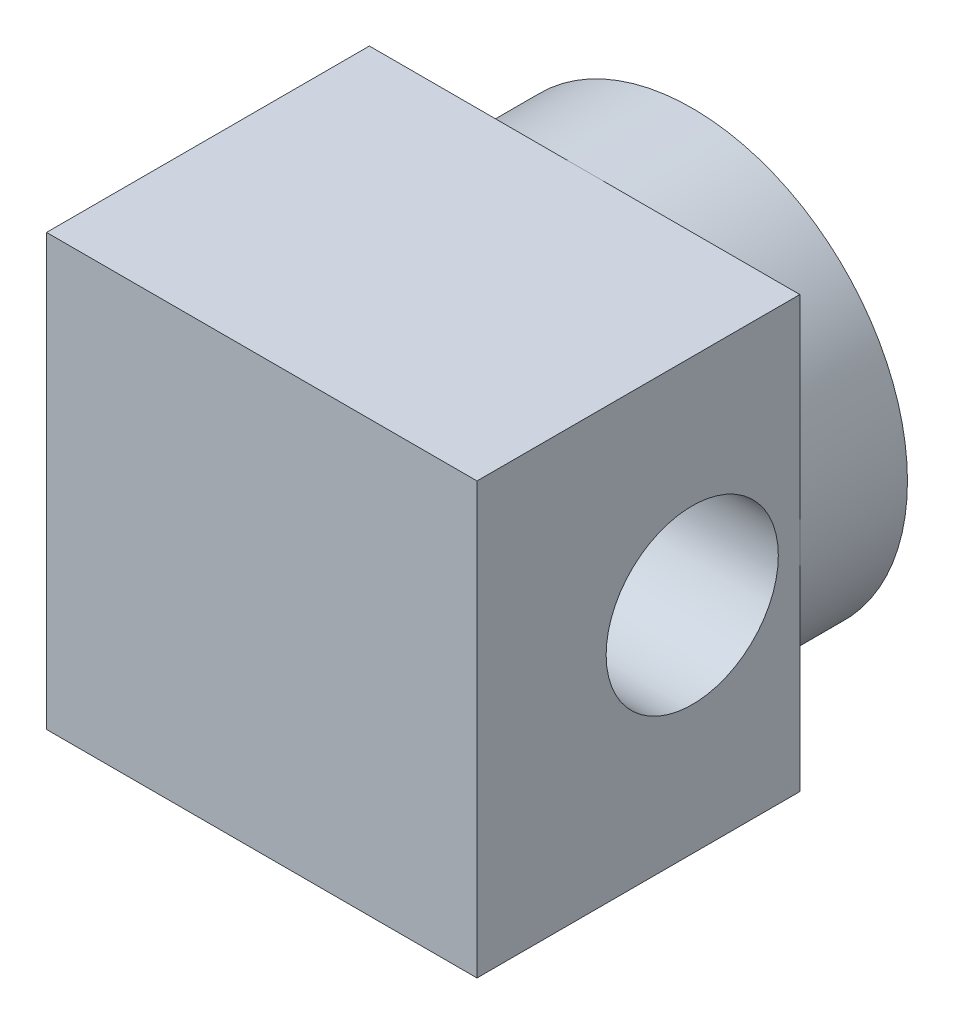
ISO-10303-21;
HEADER;
FILE_DESCRIPTION(('STEP AP214'),'2;1');
FILE_NAME('part.step','',(''),(''),'','','');
FILE_SCHEMA(('AUTOMOTIVE_DESIGN { 1 0 10303 214 1 1 1 1 }'));
ENDSEC;
DATA;
#1=APPLICATION_CONTEXT('core data for automotive mechanical design processes');
#2=APPLICATION_PROTOCOL_DEFINITION('international standard','automotive_design',2000,#1);
#3=PRODUCT_CONTEXT('',#1,'mechanical');
#4=PRODUCT('Part','Part','',(#3));
#5=PRODUCT_RELATED_PRODUCT_CATEGORY('part','',(#4));
#6=PRODUCT_DEFINITION_FORMATION('','',#4);
#7=PRODUCT_DEFINITION_CONTEXT('part definition',#1,'design');
#8=PRODUCT_DEFINITION('design','',#6,#7);
#9=PRODUCT_DEFINITION_SHAPE('','',#8);
#10=(LENGTH_UNIT() NAMED_UNIT(*) SI_UNIT(.MILLI.,.METRE.));
#11=(NAMED_UNIT(*) PLANE_ANGLE_UNIT() SI_UNIT($,.RADIAN.));
#12=(NAMED_UNIT(*) SI_UNIT($,.STERADIAN.) SOLID_ANGLE_UNIT());
#13=UNCERTAINTY_MEASURE_WITH_UNIT(LENGTH_MEASURE(1.E-05),#10,'distance_accuracy_value','');
#14=(GEOMETRIC_REPRESENTATION_CONTEXT(3) GLOBAL_UNCERTAINTY_ASSIGNED_CONTEXT((#13)) GLOBAL_UNIT_ASSIGNED_CONTEXT((#10,
#11,#12)) REPRESENTATION_CONTEXT('',''));
#15=CARTESIAN_POINT('',(0.,0.,0.));
#16=DIRECTION('',(0.,0.,1.));
#17=DIRECTION('',(1.,0.,0.));
#18=AXIS2_PLACEMENT_3D('',#15,#16,#17);
#19=CARTESIAN_POINT('',(0.,0.,10.));
#20=DIRECTION('',(0.,0.,-1.));
#21=DIRECTION('',(-1.,0.,0.));
#22=AXIS2_PLACEMENT_3D('',#19,#20,#21);
#23=CYLINDRICAL_SURFACE('',#22,5.);
#24=CARTESIAN_POINT('',(0.,0.,0.));
#25=DIRECTION('',(0.,0.,1.));
#26=DIRECTION('',(1.,0.,0.));
#27=AXIS2_PLACEMENT_3D('',#24,#25,#26);
#28=CIRCLE('',#27,5.);
#29=CARTESIAN_POINT('',(5.,0.,0.));
#30=VERTEX_POINT('',#29);
#31=EDGE_CURVE('E147',#30,#30,#28,.T.);
#32=ORIENTED_EDGE('',*,*,#31,.T.);
#33=EDGE_LOOP('',(#32));
#34=FACE_BOUND('',#33,.T.);
#35=CARTESIAN_POINT('',(0.,0.,2.5));
#36=DIRECTION('',(0.,0.,1.));
#37=DIRECTION('',(1.,0.,0.));
#38=AXIS2_PLACEMENT_3D('',#35,#36,#37);
#39=CIRCLE('',#38,5.);
#40=CARTESIAN_POINT('',(5.,0.,2.5));
#41=VERTEX_POINT('',#40);
#42=CARTESIAN_POINT('',(0.,5.,2.5));
#43=VERTEX_POINT('',#42);
#44=EDGE_CURVE('E11',#41,#43,#39,.T.);
#45=ORIENTED_EDGE('',*,*,#44,.F.);
#46=CARTESIAN_POINT('',(0.,-5.,2.5));
#47=VERTEX_POINT('',#46);
#48=EDGE_CURVE('E42',#47,#41,#39,.T.);
#49=ORIENTED_EDGE('',*,*,#48,.F.);
#50=CARTESIAN_POINT('',(-5.,0.,2.5));
#51=VERTEX_POINT('',#50);
#52=EDGE_CURVE('E58',#51,#47,#39,.T.);
#53=ORIENTED_EDGE('',*,*,#52,.F.);
#54=EDGE_CURVE('E48',#43,#51,#39,.T.);
#55=ORIENTED_EDGE('',*,*,#54,.F.);
#56=EDGE_LOOP('',(#45,#49,#53,#55));
#57=FACE_BOUND('',#56,.T.);
#58=ADVANCED_FACE('F39',(#34,#57),#23,.T.);
#59=CARTESIAN_POINT('',(0.,0.,0.));
#60=DIRECTION('',(0.,0.,1.));
#61=DIRECTION('',(1.,0.,0.));
#62=AXIS2_PLACEMENT_3D('',#59,#60,#61);
#63=PLANE('',#62);
#64=ORIENTED_EDGE('',*,*,#31,.F.);
#65=EDGE_LOOP('',(#64));
#66=FACE_BOUND('',#65,.T.);
#67=ADVANCED_FACE('F204',(#66),#63,.F.);
#68=CARTESIAN_POINT('',(0.,0.,2.5));
#69=DIRECTION('',(0.,0.,1.));
#70=DIRECTION('',(1.,0.,0.));
#71=AXIS2_PLACEMENT_3D('',#68,#69,#70);
#72=PLANE('',#71);
#73=DIRECTION('',(0.,1.,0.));
#74=VECTOR('',#73,1.);
#75=CARTESIAN_POINT('',(5.,5.,2.5));
#76=LINE('',#75,#74);
#77=CARTESIAN_POINT('',(5.,5.,2.5));
#78=VERTEX_POINT('',#77);
#79=EDGE_CURVE('E90',#41,#78,#76,.T.);
#80=ORIENTED_EDGE('',*,*,#79,.F.);
#81=ORIENTED_EDGE('',*,*,#44,.T.);
#82=DIRECTION('',(-1.,0.,0.));
#83=VECTOR('',#82,1.);
#84=CARTESIAN_POINT('',(-5.,5.,2.5));
#85=LINE('',#84,#83);
#86=EDGE_CURVE('E107',#78,#43,#85,.T.);
#87=ORIENTED_EDGE('',*,*,#86,.F.);
#88=EDGE_LOOP('',(#80,#81,#87));
#89=FACE_BOUND('',#88,.T.);
#90=ADVANCED_FACE('F114',(#89),#72,.F.);
#91=CARTESIAN_POINT('',(-5.,5.,2.5));
#92=VERTEX_POINT('',#91);
#93=EDGE_CURVE('E118',#43,#92,#85,.T.);
#94=ORIENTED_EDGE('',*,*,#93,.F.);
#95=ORIENTED_EDGE('',*,*,#54,.T.);
#96=DIRECTION('',(0.,-1.,0.));
#97=VECTOR('',#96,1.);
#98=CARTESIAN_POINT('',(-5.,5.,2.5));
#99=LINE('',#98,#97);
#100=EDGE_CURVE('E122',#92,#51,#99,.T.);
#101=ORIENTED_EDGE('',*,*,#100,.F.);
#102=EDGE_LOOP('',(#94,#95,#101));
#103=FACE_BOUND('',#102,.T.);
#104=ADVANCED_FACE('F168',(#103),#72,.F.);
#105=CARTESIAN_POINT('',(-5.,-5.,2.5));
#106=VERTEX_POINT('',#105);
#107=EDGE_CURVE('E117',#51,#106,#99,.T.);
#108=ORIENTED_EDGE('',*,*,#107,.F.);
#109=ORIENTED_EDGE('',*,*,#52,.T.);
#110=DIRECTION('',(1.,0.,0.));
#111=VECTOR('',#110,1.);
#112=CARTESIAN_POINT('',(-5.,-5.,2.5));
#113=LINE('',#112,#111);
#114=EDGE_CURVE('E112',#106,#47,#113,.T.);
#115=ORIENTED_EDGE('',*,*,#114,.F.);
#116=EDGE_LOOP('',(#108,#109,#115));
#117=FACE_BOUND('',#116,.T.);
#118=ADVANCED_FACE('F169',(#117),#72,.F.);
#119=CARTESIAN_POINT('',(5.,5.,2.5));
#120=DIRECTION('',(1.,0.,0.));
#121=DIRECTION('',(0.,1.,0.));
#122=AXIS2_PLACEMENT_3D('',#119,#120,#121);
#123=PLANE('',#122);
#124=CARTESIAN_POINT('',(5.,0.,5.));
#125=DIRECTION('',(1.,0.,0.));
#126=DIRECTION('',(0.,0.,-1.));
#127=AXIS2_PLACEMENT_3D('',#124,#125,#126);
#128=CIRCLE('',#127,2.);
#129=CARTESIAN_POINT('',(5.,0.,3.));
#130=VERTEX_POINT('',#129);
#131=EDGE_CURVE('E186',#130,#130,#128,.T.);
#132=ORIENTED_EDGE('',*,*,#131,.F.);
#133=EDGE_LOOP('',(#132));
#134=FACE_BOUND('',#133,.T.);
#135=CARTESIAN_POINT('',(5.,-5.,2.5));
#136=VERTEX_POINT('',#135);
#137=EDGE_CURVE('E98',#136,#41,#76,.T.);
#138=ORIENTED_EDGE('',*,*,#137,.T.);
#139=ORIENTED_EDGE('',*,*,#79,.T.);
#140=DIRECTION('',(0.,0.,1.));
#141=VECTOR('',#140,1.);
#142=CARTESIAN_POINT('',(5.,5.,2.5));
#143=LINE('',#142,#141);
#144=CARTESIAN_POINT('',(5.,5.,10.));
#145=VERTEX_POINT('',#144);
#146=EDGE_CURVE('E94',#78,#145,#143,.T.);
#147=ORIENTED_EDGE('',*,*,#146,.T.);
#148=DIRECTION('',(0.,1.,0.));
#149=VECTOR('',#148,1.);
#150=CARTESIAN_POINT('',(5.,5.,10.));
#151=LINE('',#150,#149);
#152=CARTESIAN_POINT('',(5.,-5.,10.));
#153=VERTEX_POINT('',#152);
#154=EDGE_CURVE('E132',#153,#145,#151,.T.);
#155=ORIENTED_EDGE('',*,*,#154,.F.);
#156=DIRECTION('',(0.,0.,1.));
#157=VECTOR('',#156,1.);
#158=CARTESIAN_POINT('',(5.,-5.,2.5));
#159=LINE('',#158,#157);
#160=EDGE_CURVE('E143',#136,#153,#159,.T.);
#161=ORIENTED_EDGE('',*,*,#160,.F.);
#162=EDGE_LOOP('',(#138,#139,#147,#155,#161));
#163=FACE_BOUND('',#162,.T.);
#164=ADVANCED_FACE('F92',(#134,#163),#123,.T.);
#165=CARTESIAN_POINT('',(-5.,-5.,2.5));
#166=DIRECTION('',(0.,-1.,0.));
#167=DIRECTION('',(0.,0.,-1.));
#168=AXIS2_PLACEMENT_3D('',#165,#166,#167);
#169=PLANE('',#168);
#170=ORIENTED_EDGE('',*,*,#114,.T.);
#171=EDGE_CURVE('E128',#47,#136,#113,.T.);
#172=ORIENTED_EDGE('',*,*,#171,.T.);
#173=ORIENTED_EDGE('',*,*,#160,.T.);
#174=DIRECTION('',(1.,0.,0.));
#175=VECTOR('',#174,1.);
#176=CARTESIAN_POINT('',(-5.,-5.,10.));
#177=LINE('',#176,#175);
#178=CARTESIAN_POINT('',(-5.,-5.,10.));
#179=VERTEX_POINT('',#178);
#180=EDGE_CURVE('E102',#179,#153,#177,.T.);
#181=ORIENTED_EDGE('',*,*,#180,.F.);
#182=DIRECTION('',(0.,0.,1.));
#183=VECTOR('',#182,1.);
#184=CARTESIAN_POINT('',(-5.,-5.,2.5));
#185=LINE('',#184,#183);
#186=EDGE_CURVE('E148',#106,#179,#185,.T.);
#187=ORIENTED_EDGE('',*,*,#186,.F.);
#188=EDGE_LOOP('',(#170,#172,#173,#181,#187));
#189=FACE_BOUND('',#188,.T.);
#190=ADVANCED_FACE('F179',(#189),#169,.T.);
#191=CARTESIAN_POINT('',(-5.,5.,2.5));
#192=DIRECTION('',(-1.,0.,0.));
#193=DIRECTION('',(0.,-1.,0.));
#194=AXIS2_PLACEMENT_3D('',#191,#192,#193);
#195=PLANE('',#194);
#196=CARTESIAN_POINT('',(-5.,0.,5.));
#197=DIRECTION('',(1.,0.,0.));
#198=DIRECTION('',(0.,0.,-1.));
#199=AXIS2_PLACEMENT_3D('',#196,#197,#198);
#200=CIRCLE('',#199,2.);
#201=CARTESIAN_POINT('',(-5.,0.,3.));
#202=VERTEX_POINT('',#201);
#203=EDGE_CURVE('E135',#202,#202,#200,.T.);
#204=ORIENTED_EDGE('',*,*,#203,.T.);
#205=EDGE_LOOP('',(#204));
#206=FACE_BOUND('',#205,.T.);
#207=ORIENTED_EDGE('',*,*,#100,.T.);
#208=ORIENTED_EDGE('',*,*,#107,.T.);
#209=ORIENTED_EDGE('',*,*,#186,.T.);
#210=DIRECTION('',(0.,-1.,0.));
#211=VECTOR('',#210,1.);
#212=CARTESIAN_POINT('',(-5.,5.,10.));
#213=LINE('',#212,#211);
#214=CARTESIAN_POINT('',(-5.,5.,10.));
#215=VERTEX_POINT('',#214);
#216=EDGE_CURVE('E138',#215,#179,#213,.T.);
#217=ORIENTED_EDGE('',*,*,#216,.F.);
#218=DIRECTION('',(0.,0.,1.));
#219=VECTOR('',#218,1.);
#220=CARTESIAN_POINT('',(-5.,5.,2.5));
#221=LINE('',#220,#219);
#222=EDGE_CURVE('E111',#92,#215,#221,.T.);
#223=ORIENTED_EDGE('',*,*,#222,.F.);
#224=EDGE_LOOP('',(#207,#208,#209,#217,#223));
#225=FACE_BOUND('',#224,.T.);
#226=ADVANCED_FACE('F173',(#206,#225),#195,.T.);
#227=CARTESIAN_POINT('',(-5.,5.,2.5));
#228=DIRECTION('',(0.,1.,0.));
#229=DIRECTION('',(0.,0.,1.));
#230=AXIS2_PLACEMENT_3D('',#227,#228,#229);
#231=PLANE('',#230);
#232=ORIENTED_EDGE('',*,*,#86,.T.);
#233=ORIENTED_EDGE('',*,*,#93,.T.);
#234=ORIENTED_EDGE('',*,*,#222,.T.);
#235=DIRECTION('',(-1.,0.,0.));
#236=VECTOR('',#235,1.);
#237=CARTESIAN_POINT('',(-5.,5.,10.));
#238=LINE('',#237,#236);
#239=EDGE_CURVE('E109',#145,#215,#238,.T.);
#240=ORIENTED_EDGE('',*,*,#239,.F.);
#241=ORIENTED_EDGE('',*,*,#146,.F.);
#242=EDGE_LOOP('',(#232,#233,#234,#240,#241));
#243=FACE_BOUND('',#242,.T.);
#244=ADVANCED_FACE('F106',(#243),#231,.T.);
#245=ORIENTED_EDGE('',*,*,#171,.F.);
#246=ORIENTED_EDGE('',*,*,#48,.T.);
#247=ORIENTED_EDGE('',*,*,#137,.F.);
#248=EDGE_LOOP('',(#245,#246,#247));
#249=FACE_BOUND('',#248,.T.);
#250=ADVANCED_FACE('F181',(#249),#72,.F.);
#251=CARTESIAN_POINT('',(0.,0.,10.));
#252=DIRECTION('',(0.,0.,1.));
#253=DIRECTION('',(1.,0.,0.));
#254=AXIS2_PLACEMENT_3D('',#251,#252,#253);
#255=PLANE('',#254);
#256=ORIENTED_EDGE('',*,*,#180,.T.);
#257=ORIENTED_EDGE('',*,*,#154,.T.);
#258=ORIENTED_EDGE('',*,*,#239,.T.);
#259=ORIENTED_EDGE('',*,*,#216,.T.);
#260=EDGE_LOOP('',(#256,#257,#258,#259));
#261=FACE_BOUND('',#260,.T.);
#262=ADVANCED_FACE('F177',(#261),#255,.T.);
#263=CARTESIAN_POINT('',(-5.,0.,5.));
#264=DIRECTION('',(1.,0.,0.));
#265=DIRECTION('',(0.,0.,-1.));
#266=AXIS2_PLACEMENT_3D('',#263,#264,#265);
#267=CYLINDRICAL_SURFACE('',#266,2.);
#268=ORIENTED_EDGE('',*,*,#203,.F.);
#269=EDGE_LOOP('',(#268));
#270=FACE_BOUND('',#269,.T.);
#271=ORIENTED_EDGE('',*,*,#131,.T.);
#272=EDGE_LOOP('',(#271));
#273=FACE_BOUND('',#272,.T.);
#274=ADVANCED_FACE('F191',(#270,#273),#267,.F.);
#275=CLOSED_SHELL('',(#58,#67,#90,#104,#118,#164,#190,#226,#244,#250,#262,#274));
#276=MANIFOLD_SOLID_BREP('B2',#275);
#277=ADVANCED_BREP_SHAPE_REPRESENTATION('',(#18,#276),#14);
#278=SHAPE_DEFINITION_REPRESENTATION(#9,#277);
ENDSEC;
END-ISO-10303-21;
